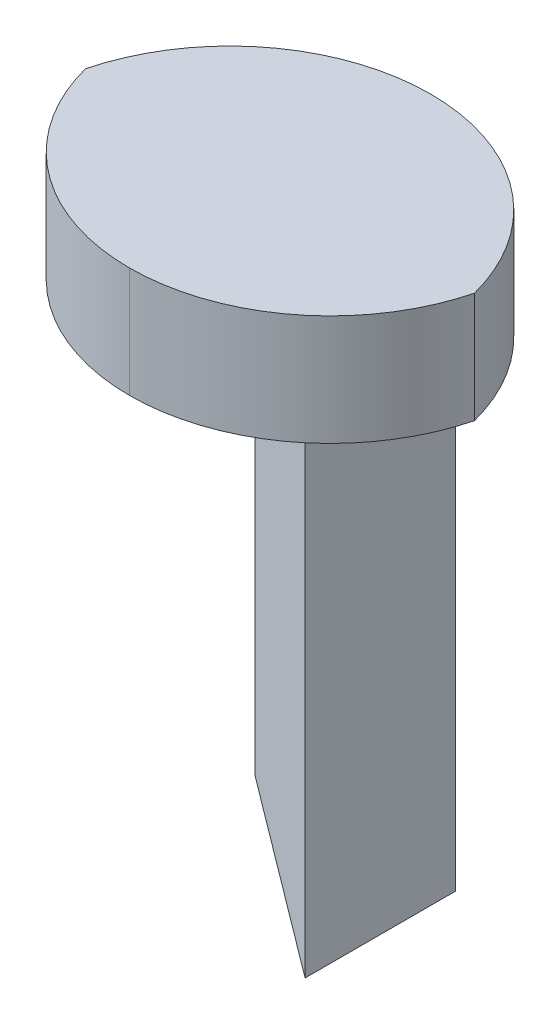
ISO-10303-21;
HEADER;
FILE_DESCRIPTION(('STEP AP214'),'2;1');
FILE_NAME('part.step','',(''),(''),'','','');
FILE_SCHEMA(('AUTOMOTIVE_DESIGN { 1 0 10303 214 1 1 1 1 }'));
ENDSEC;
DATA;
#1=APPLICATION_CONTEXT('core data for automotive mechanical design processes');
#2=APPLICATION_PROTOCOL_DEFINITION('international standard','automotive_design',2000,#1);
#3=PRODUCT_CONTEXT('',#1,'mechanical');
#4=PRODUCT('Part','Part','',(#3));
#5=PRODUCT_RELATED_PRODUCT_CATEGORY('part','',(#4));
#6=PRODUCT_DEFINITION_FORMATION('','',#4);
#7=PRODUCT_DEFINITION_CONTEXT('part definition',#1,'design');
#8=PRODUCT_DEFINITION('design','',#6,#7);
#9=PRODUCT_DEFINITION_SHAPE('','',#8);
#10=(LENGTH_UNIT() NAMED_UNIT(*) SI_UNIT(.MILLI.,.METRE.));
#11=(NAMED_UNIT(*) PLANE_ANGLE_UNIT() SI_UNIT($,.RADIAN.));
#12=(NAMED_UNIT(*) SI_UNIT($,.STERADIAN.) SOLID_ANGLE_UNIT());
#13=UNCERTAINTY_MEASURE_WITH_UNIT(LENGTH_MEASURE(1.E-05),#10,'distance_accuracy_value','');
#14=(GEOMETRIC_REPRESENTATION_CONTEXT(3) GLOBAL_UNCERTAINTY_ASSIGNED_CONTEXT((#13)) GLOBAL_UNIT_ASSIGNED_CONTEXT((#10,
#11,#12)) REPRESENTATION_CONTEXT('',''));
#15=CARTESIAN_POINT('',(0.,0.,0.));
#16=DIRECTION('',(0.,0.,1.));
#17=DIRECTION('',(1.,0.,0.));
#18=AXIS2_PLACEMENT_3D('',#15,#16,#17);
#19=CARTESIAN_POINT('',(0.,-2.794,0.));
#20=DIRECTION('',(0.,1.,0.));
#21=DIRECTION('',(0.,0.,1.));
#22=AXIS2_PLACEMENT_3D('',#19,#20,#21);
#23=PLANE('',#22);
#24=DIRECTION('',(-1.,0.,0.));
#25=VECTOR('',#24,1.);
#26=CARTESIAN_POINT('',(0.,-2.794,-1.905));
#27=LINE('',#26,#25);
#28=CARTESIAN_POINT('',(2.54,-2.794,-1.905));
#29=VERTEX_POINT('',#28);
#30=CARTESIAN_POINT('',(-2.54,-2.794,-1.905));
#31=VERTEX_POINT('',#30);
#32=EDGE_CURVE('E143',#29,#31,#27,.T.);
#33=ORIENTED_EDGE('',*,*,#32,.T.);
#34=DIRECTION('',(0.8,0.,0.6));
#35=VECTOR('',#34,1.);
#36=CARTESIAN_POINT('',(0.,-2.794,0.));
#37=LINE('',#36,#35);
#38=CARTESIAN_POINT('',(2.54,-2.794,1.905));
#39=VERTEX_POINT('',#38);
#40=EDGE_CURVE('E147',#31,#39,#37,.T.);
#41=ORIENTED_EDGE('',*,*,#40,.T.);
#42=DIRECTION('',(0.,0.,-1.));
#43=VECTOR('',#42,1.);
#44=CARTESIAN_POINT('',(2.54,-2.794,0.));
#45=LINE('',#44,#43);
#46=EDGE_CURVE('E111',#39,#29,#45,.T.);
#47=ORIENTED_EDGE('',*,*,#46,.T.);
#48=EDGE_LOOP('',(#33,#41,#47));
#49=FACE_BOUND('',#48,.T.);
#50=CARTESIAN_POINT('',(0.,-2.794,-1.27));
#51=DIRECTION('',(0.,1.,0.));
#52=DIRECTION('',(0.,0.,1.));
#53=AXIS2_PLACEMENT_3D('',#50,#51,#52);
#54=CIRCLE('',#53,5.08);
#55=CARTESIAN_POINT('',(4.91868884968342,-2.794,0.));
#56=VERTEX_POINT('',#55);
#57=CARTESIAN_POINT('',(0.,-2.794,3.81));
#58=VERTEX_POINT('',#57);
#59=EDGE_CURVE('E163',#56,#58,#54,.F.);
#60=ORIENTED_EDGE('',*,*,#59,.T.);
#61=CARTESIAN_POINT('',(0.,-2.794,-1.27));
#62=DIRECTION('',(0.,1.,0.));
#63=DIRECTION('',(0.,0.,1.));
#64=AXIS2_PLACEMENT_3D('',#61,#62,#63);
#65=CIRCLE('',#64,5.08);
#66=CARTESIAN_POINT('',(-4.91868884968342,-2.794,0.));
#67=VERTEX_POINT('',#66);
#68=EDGE_CURVE('E11',#58,#67,#65,.F.);
#69=ORIENTED_EDGE('',*,*,#68,.T.);
#70=CARTESIAN_POINT('',(0.,-2.794,1.27));
#71=DIRECTION('',(0.,1.,0.));
#72=DIRECTION('',(0.,0.,1.));
#73=AXIS2_PLACEMENT_3D('',#70,#71,#72);
#74=CIRCLE('',#73,5.08);
#75=CARTESIAN_POINT('',(0.,-2.794,-3.81));
#76=VERTEX_POINT('',#75);
#77=EDGE_CURVE('E51',#67,#76,#74,.F.);
#78=ORIENTED_EDGE('',*,*,#77,.T.);
#79=CARTESIAN_POINT('',(0.,-2.794,1.27));
#80=DIRECTION('',(0.,1.,0.));
#81=DIRECTION('',(0.,0.,1.));
#82=AXIS2_PLACEMENT_3D('',#79,#80,#81);
#83=CIRCLE('',#82,5.08);
#84=EDGE_CURVE('E67',#76,#56,#83,.F.);
#85=ORIENTED_EDGE('',*,*,#84,.T.);
#86=EDGE_LOOP('',(#60,#69,#78,#85));
#87=FACE_BOUND('',#86,.T.);
#88=ADVANCED_FACE('F41',(#49,#87),#23,.F.);
#89=CARTESIAN_POINT('',(0.,0.,0.));
#90=DIRECTION('',(0.,1.,0.));
#91=DIRECTION('',(0.,0.,1.));
#92=AXIS2_PLACEMENT_3D('',#89,#90,#91);
#93=PLANE('',#92);
#94=CARTESIAN_POINT('',(0.,0.,1.27));
#95=DIRECTION('',(0.,1.,0.));
#96=DIRECTION('',(0.,0.,1.));
#97=AXIS2_PLACEMENT_3D('',#94,#95,#96);
#98=CIRCLE('',#97,5.08);
#99=CARTESIAN_POINT('',(0.,0.,-3.81));
#100=VERTEX_POINT('',#99);
#101=CARTESIAN_POINT('',(-4.91868884968342,0.,0.));
#102=VERTEX_POINT('',#101);
#103=EDGE_CURVE('E156',#100,#102,#98,.T.);
#104=ORIENTED_EDGE('',*,*,#103,.T.);
#105=CARTESIAN_POINT('',(0.,0.,-1.27));
#106=DIRECTION('',(0.,1.,0.));
#107=DIRECTION('',(0.,0.,1.));
#108=AXIS2_PLACEMENT_3D('',#105,#106,#107);
#109=CIRCLE('',#108,5.08);
#110=CARTESIAN_POINT('',(0.,0.,3.81));
#111=VERTEX_POINT('',#110);
#112=EDGE_CURVE('E159',#102,#111,#109,.T.);
#113=ORIENTED_EDGE('',*,*,#112,.T.);
#114=CARTESIAN_POINT('',(0.,0.,-1.27));
#115=DIRECTION('',(0.,1.,0.));
#116=DIRECTION('',(0.,0.,1.));
#117=AXIS2_PLACEMENT_3D('',#114,#115,#116);
#118=CIRCLE('',#117,5.08);
#119=CARTESIAN_POINT('',(4.91868884968342,0.,0.));
#120=VERTEX_POINT('',#119);
#121=EDGE_CURVE('E150',#111,#120,#118,.T.);
#122=ORIENTED_EDGE('',*,*,#121,.T.);
#123=CARTESIAN_POINT('',(0.,0.,1.27));
#124=DIRECTION('',(0.,1.,0.));
#125=DIRECTION('',(0.,0.,1.));
#126=AXIS2_PLACEMENT_3D('',#123,#124,#125);
#127=CIRCLE('',#126,5.08);
#128=EDGE_CURVE('E153',#120,#100,#127,.T.);
#129=ORIENTED_EDGE('',*,*,#128,.T.);
#130=EDGE_LOOP('',(#104,#113,#122,#129));
#131=FACE_BOUND('',#130,.T.);
#132=ADVANCED_FACE('F189',(#131),#93,.T.);
#133=CARTESIAN_POINT('',(2.54,-15.24,1.905));
#134=DIRECTION('',(-0.6,0.,0.8));
#135=DIRECTION('',(0.8,0.,0.6));
#136=AXIS2_PLACEMENT_3D('',#133,#134,#135);
#137=PLANE('',#136);
#138=ORIENTED_EDGE('',*,*,#40,.F.);
#139=DIRECTION('',(0.,1.,0.));
#140=VECTOR('',#139,1.);
#141=CARTESIAN_POINT('',(-2.54,-15.24,-1.905));
#142=LINE('',#141,#140);
#143=CARTESIAN_POINT('',(-2.54,-15.24,-1.905));
#144=VERTEX_POINT('',#143);
#145=EDGE_CURVE('E128',#144,#31,#142,.T.);
#146=ORIENTED_EDGE('',*,*,#145,.F.);
#147=DIRECTION('',(0.8,0.,0.6));
#148=VECTOR('',#147,1.);
#149=CARTESIAN_POINT('',(2.54,-15.24,1.905));
#150=LINE('',#149,#148);
#151=CARTESIAN_POINT('',(2.54,-15.24,1.905));
#152=VERTEX_POINT('',#151);
#153=EDGE_CURVE('E122',#144,#152,#150,.T.);
#154=ORIENTED_EDGE('',*,*,#153,.T.);
#155=DIRECTION('',(0.,1.,0.));
#156=VECTOR('',#155,1.);
#157=CARTESIAN_POINT('',(2.54,-15.24,1.905));
#158=LINE('',#157,#156);
#159=EDGE_CURVE('E105',#152,#39,#158,.T.);
#160=ORIENTED_EDGE('',*,*,#159,.T.);
#161=EDGE_LOOP('',(#138,#146,#154,#160));
#162=FACE_BOUND('',#161,.T.);
#163=ADVANCED_FACE('F126',(#162),#137,.T.);
#164=CARTESIAN_POINT('',(-2.54,-15.24,-1.905));
#165=DIRECTION('',(0.,0.,-1.));
#166=DIRECTION('',(-1.,0.,0.));
#167=AXIS2_PLACEMENT_3D('',#164,#165,#166);
#168=PLANE('',#167);
#169=ORIENTED_EDGE('',*,*,#32,.F.);
#170=DIRECTION('',(0.,1.,0.));
#171=VECTOR('',#170,1.);
#172=CARTESIAN_POINT('',(2.54,-15.24,-1.905));
#173=LINE('',#172,#171);
#174=CARTESIAN_POINT('',(2.54,-15.24,-1.905));
#175=VERTEX_POINT('',#174);
#176=EDGE_CURVE('E116',#175,#29,#173,.T.);
#177=ORIENTED_EDGE('',*,*,#176,.F.);
#178=DIRECTION('',(-1.,0.,0.));
#179=VECTOR('',#178,1.);
#180=CARTESIAN_POINT('',(-2.54,-15.24,-1.905));
#181=LINE('',#180,#179);
#182=EDGE_CURVE('E117',#175,#144,#181,.T.);
#183=ORIENTED_EDGE('',*,*,#182,.T.);
#184=ORIENTED_EDGE('',*,*,#145,.T.);
#185=EDGE_LOOP('',(#169,#177,#183,#184));
#186=FACE_BOUND('',#185,.T.);
#187=ADVANCED_FACE('F196',(#186),#168,.T.);
#188=CARTESIAN_POINT('',(2.54,-15.24,-1.905));
#189=DIRECTION('',(1.,0.,0.));
#190=DIRECTION('',(0.,0.,-1.));
#191=AXIS2_PLACEMENT_3D('',#188,#189,#190);
#192=PLANE('',#191);
#193=ORIENTED_EDGE('',*,*,#46,.F.);
#194=ORIENTED_EDGE('',*,*,#159,.F.);
#195=DIRECTION('',(0.,0.,-1.));
#196=VECTOR('',#195,1.);
#197=CARTESIAN_POINT('',(2.54,-15.24,-1.905));
#198=LINE('',#197,#196);
#199=EDGE_CURVE('E108',#152,#175,#198,.T.);
#200=ORIENTED_EDGE('',*,*,#199,.T.);
#201=ORIENTED_EDGE('',*,*,#176,.T.);
#202=EDGE_LOOP('',(#193,#194,#200,#201));
#203=FACE_BOUND('',#202,.T.);
#204=ADVANCED_FACE('F107',(#203),#192,.T.);
#205=CARTESIAN_POINT('',(0.,-15.24,0.));
#206=DIRECTION('',(0.,1.,0.));
#207=DIRECTION('',(0.,0.,1.));
#208=AXIS2_PLACEMENT_3D('',#205,#206,#207);
#209=PLANE('',#208);
#210=ORIENTED_EDGE('',*,*,#153,.F.);
#211=ORIENTED_EDGE('',*,*,#182,.F.);
#212=ORIENTED_EDGE('',*,*,#199,.F.);
#213=EDGE_LOOP('',(#210,#211,#212));
#214=FACE_BOUND('',#213,.T.);
#215=ADVANCED_FACE('F121',(#214),#209,.F.);
#216=CARTESIAN_POINT('',(0.,-2.794,1.27));
#217=DIRECTION('',(0.,1.,0.));
#218=DIRECTION('',(0.,0.,1.));
#219=AXIS2_PLACEMENT_3D('',#216,#217,#218);
#220=CYLINDRICAL_SURFACE('',#219,5.08);
#221=DIRECTION('',(0.,1.,0.));
#222=VECTOR('',#221,1.);
#223=CARTESIAN_POINT('',(0.,-2.794,-3.81));
#224=LINE('',#223,#222);
#225=EDGE_CURVE('E133',#100,#76,#224,.F.);
#226=ORIENTED_EDGE('',*,*,#225,.F.);
#227=ORIENTED_EDGE('',*,*,#128,.F.);
#228=DIRECTION('',(0.,-1.,0.));
#229=VECTOR('',#228,1.);
#230=CARTESIAN_POINT('',(4.91868884968342,-1.397,0.));
#231=LINE('',#230,#229);
#232=EDGE_CURVE('E45',#56,#120,#231,.F.);
#233=ORIENTED_EDGE('',*,*,#232,.F.);
#234=ORIENTED_EDGE('',*,*,#84,.F.);
#235=EDGE_LOOP('',(#226,#227,#233,#234));
#236=FACE_BOUND('',#235,.T.);
#237=ADVANCED_FACE('F43',(#236),#220,.T.);
#238=CARTESIAN_POINT('',(0.,-2.794,-1.27));
#239=DIRECTION('',(0.,-1.,0.));
#240=DIRECTION('',(0.,0.,-1.));
#241=AXIS2_PLACEMENT_3D('',#238,#239,#240);
#242=CYLINDRICAL_SURFACE('',#241,5.08);
#243=ORIENTED_EDGE('',*,*,#232,.T.);
#244=ORIENTED_EDGE('',*,*,#121,.F.);
#245=DIRECTION('',(0.,1.,0.));
#246=VECTOR('',#245,1.);
#247=CARTESIAN_POINT('',(0.,0.,3.81));
#248=LINE('',#247,#246);
#249=EDGE_CURVE('E172',#58,#111,#248,.T.);
#250=ORIENTED_EDGE('',*,*,#249,.F.);
#251=ORIENTED_EDGE('',*,*,#59,.F.);
#252=EDGE_LOOP('',(#243,#244,#250,#251));
#253=FACE_BOUND('',#252,.T.);
#254=ADVANCED_FACE('F186',(#253),#242,.T.);
#255=CARTESIAN_POINT('',(0.,-2.794,1.27));
#256=DIRECTION('',(0.,-1.,0.));
#257=DIRECTION('',(0.,0.,-1.));
#258=AXIS2_PLACEMENT_3D('',#255,#256,#257);
#259=CYLINDRICAL_SURFACE('',#258,5.08);
#260=ORIENTED_EDGE('',*,*,#225,.T.);
#261=ORIENTED_EDGE('',*,*,#77,.F.);
#262=DIRECTION('',(0.,-1.,0.));
#263=VECTOR('',#262,1.);
#264=CARTESIAN_POINT('',(-4.91868884968342,-1.397,0.));
#265=LINE('',#264,#263);
#266=EDGE_CURVE('E59',#102,#67,#265,.T.);
#267=ORIENTED_EDGE('',*,*,#266,.F.);
#268=ORIENTED_EDGE('',*,*,#103,.F.);
#269=EDGE_LOOP('',(#260,#261,#267,#268));
#270=FACE_BOUND('',#269,.T.);
#271=ADVANCED_FACE('F179',(#270),#259,.T.);
#272=CARTESIAN_POINT('',(0.,-2.794,-1.27));
#273=DIRECTION('',(0.,1.,0.));
#274=DIRECTION('',(0.,0.,1.));
#275=AXIS2_PLACEMENT_3D('',#272,#273,#274);
#276=CYLINDRICAL_SURFACE('',#275,5.08);
#277=ORIENTED_EDGE('',*,*,#68,.F.);
#278=ORIENTED_EDGE('',*,*,#249,.T.);
#279=ORIENTED_EDGE('',*,*,#112,.F.);
#280=ORIENTED_EDGE('',*,*,#266,.T.);
#281=EDGE_LOOP('',(#277,#278,#279,#280));
#282=FACE_BOUND('',#281,.T.);
#283=ADVANCED_FACE('F187',(#282),#276,.T.);
#284=CLOSED_SHELL('',(#88,#132,#163,#187,#204,#215,#237,#254,#271,#283));
#285=MANIFOLD_SOLID_BREP('B2',#284);
#286=ADVANCED_BREP_SHAPE_REPRESENTATION('',(#18,#285),#14);
#287=SHAPE_DEFINITION_REPRESENTATION(#9,#286);
ENDSEC;
END-ISO-10303-21;
